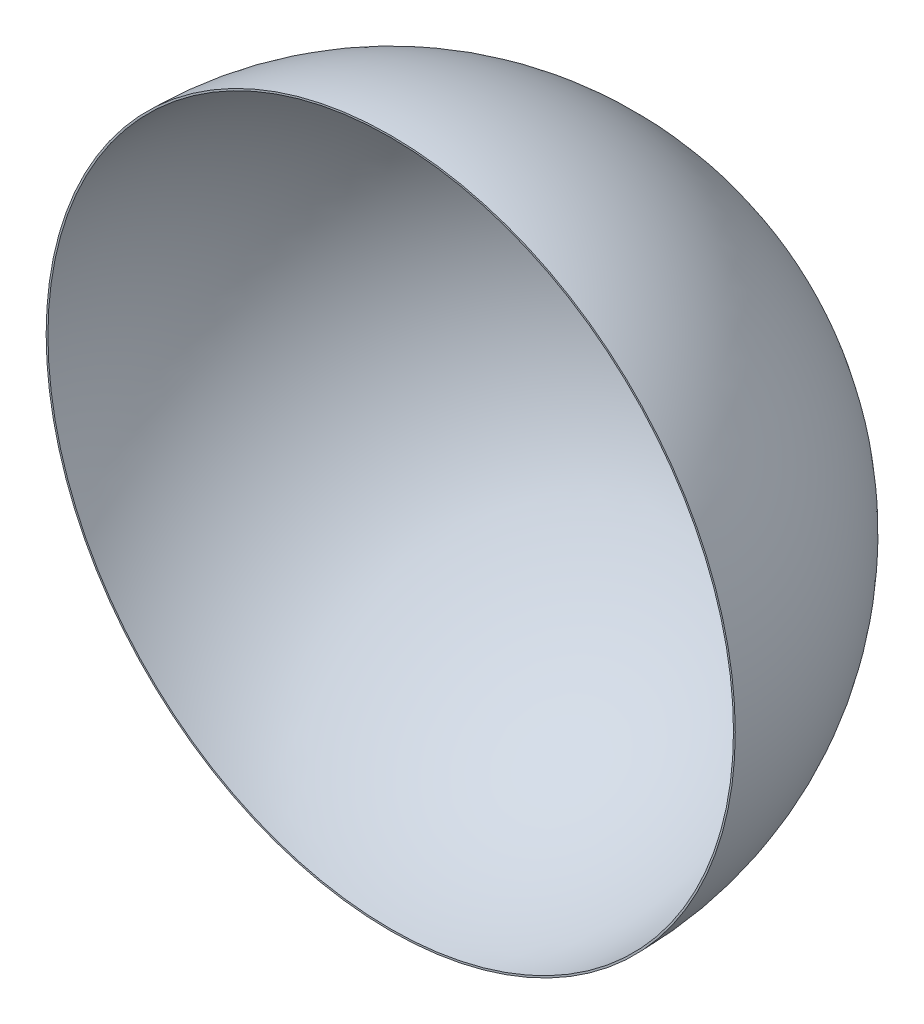
ISO-10303-21;
HEADER;
FILE_DESCRIPTION(('STEP AP214'),'2;1');
FILE_NAME('part.step','',(''),(''),'','','');
FILE_SCHEMA(('AUTOMOTIVE_DESIGN { 1 0 10303 214 1 1 1 1 }'));
ENDSEC;
DATA;
#1=APPLICATION_CONTEXT('core data for automotive mechanical design processes');
#2=APPLICATION_PROTOCOL_DEFINITION('international standard','automotive_design',2000,#1);
#3=PRODUCT_CONTEXT('',#1,'mechanical');
#4=PRODUCT('Part','Part','',(#3));
#5=PRODUCT_RELATED_PRODUCT_CATEGORY('part','',(#4));
#6=PRODUCT_DEFINITION_FORMATION('','',#4);
#7=PRODUCT_DEFINITION_CONTEXT('part definition',#1,'design');
#8=PRODUCT_DEFINITION('design','',#6,#7);
#9=PRODUCT_DEFINITION_SHAPE('','',#8);
#10=(LENGTH_UNIT() NAMED_UNIT(*) SI_UNIT(.MILLI.,.METRE.));
#11=(NAMED_UNIT(*) PLANE_ANGLE_UNIT() SI_UNIT($,.RADIAN.));
#12=(NAMED_UNIT(*) SI_UNIT($,.STERADIAN.) SOLID_ANGLE_UNIT());
#13=UNCERTAINTY_MEASURE_WITH_UNIT(LENGTH_MEASURE(1.E-05),#10,'distance_accuracy_value','');
#14=(GEOMETRIC_REPRESENTATION_CONTEXT(3) GLOBAL_UNCERTAINTY_ASSIGNED_CONTEXT((#13)) GLOBAL_UNIT_ASSIGNED_CONTEXT((#10,
#11,#12)) REPRESENTATION_CONTEXT('',''));
#15=CARTESIAN_POINT('',(0.,0.,0.));
#16=DIRECTION('',(0.,0.,1.));
#17=DIRECTION('',(1.,0.,0.));
#18=AXIS2_PLACEMENT_3D('',#15,#16,#17);
#19=CARTESIAN_POINT('',(5.97235751008181E-13,0.,4876.8));
#20=DIRECTION('',(0.,0.,-1.));
#21=DIRECTION('',(1.,0.,0.));
#22=AXIS2_PLACEMENT_3D('',#19,#20,#21);
#23=SPHERICAL_SURFACE('',#22,4876.8);
#24=CARTESIAN_POINT('',(5.97235751008182E-13,0.,4876.8));
#25=DIRECTION('',(0.,0.,-1.));
#26=DIRECTION('',(-1.,0.,0.));
#27=AXIS2_PLACEMENT_3D('',#24,#25,#26);
#28=CIRCLE('',#27,4876.8);
#29=CARTESIAN_POINT('',(-4876.8,0.,4876.8));
#30=VERTEX_POINT('',#29);
#31=EDGE_CURVE('E39',#30,#30,#28,.T.);
#32=ORIENTED_EDGE('',*,*,#31,.F.);
#33=EDGE_LOOP('',(#32));
#34=FACE_BOUND('',#33,.T.);
#35=ADVANCED_FACE('F33',(#34),#23,.F.);
#36=CARTESIAN_POINT('',(5.97235751008181E-13,0.,4876.8));
#37=DIRECTION('',(0.,0.,-1.));
#38=DIRECTION('',(1.,0.,0.));
#39=AXIS2_PLACEMENT_3D('',#36,#37,#38);
#40=SPHERICAL_SURFACE('',#39,4902.2);
#41=CARTESIAN_POINT('',(5.97235751008181E-13,0.,4876.8));
#42=DIRECTION('',(0.,0.,-1.));
#43=DIRECTION('',(-1.,0.,0.));
#44=AXIS2_PLACEMENT_3D('',#41,#42,#43);
#45=CIRCLE('',#44,4902.2);
#46=CARTESIAN_POINT('',(-4902.2,0.,4876.8));
#47=VERTEX_POINT('',#46);
#48=EDGE_CURVE('E10',#47,#47,#45,.T.);
#49=ORIENTED_EDGE('',*,*,#48,.T.);
#50=EDGE_LOOP('',(#49));
#51=FACE_BOUND('',#50,.T.);
#52=ADVANCED_FACE('F48',(#51),#40,.T.);
#53=CARTESIAN_POINT('',(4876.8,0.,4876.8));
#54=DIRECTION('',(0.,0.,-1.));
#55=DIRECTION('',(-1.,0.,0.));
#56=AXIS2_PLACEMENT_3D('',#53,#54,#55);
#57=PLANE('',#56);
#58=ORIENTED_EDGE('',*,*,#48,.F.);
#59=EDGE_LOOP('',(#58));
#60=FACE_BOUND('',#59,.T.);
#61=ORIENTED_EDGE('',*,*,#31,.T.);
#62=EDGE_LOOP('',(#61));
#63=FACE_BOUND('',#62,.T.);
#64=ADVANCED_FACE('F45',(#60,#63),#57,.F.);
#65=CLOSED_SHELL('',(#35,#52,#64));
#66=MANIFOLD_SOLID_BREP('B2',#65);
#67=ADVANCED_BREP_SHAPE_REPRESENTATION('',(#18,#66),#14);
#68=SHAPE_DEFINITION_REPRESENTATION(#9,#67);
ENDSEC;
END-ISO-10303-21;
